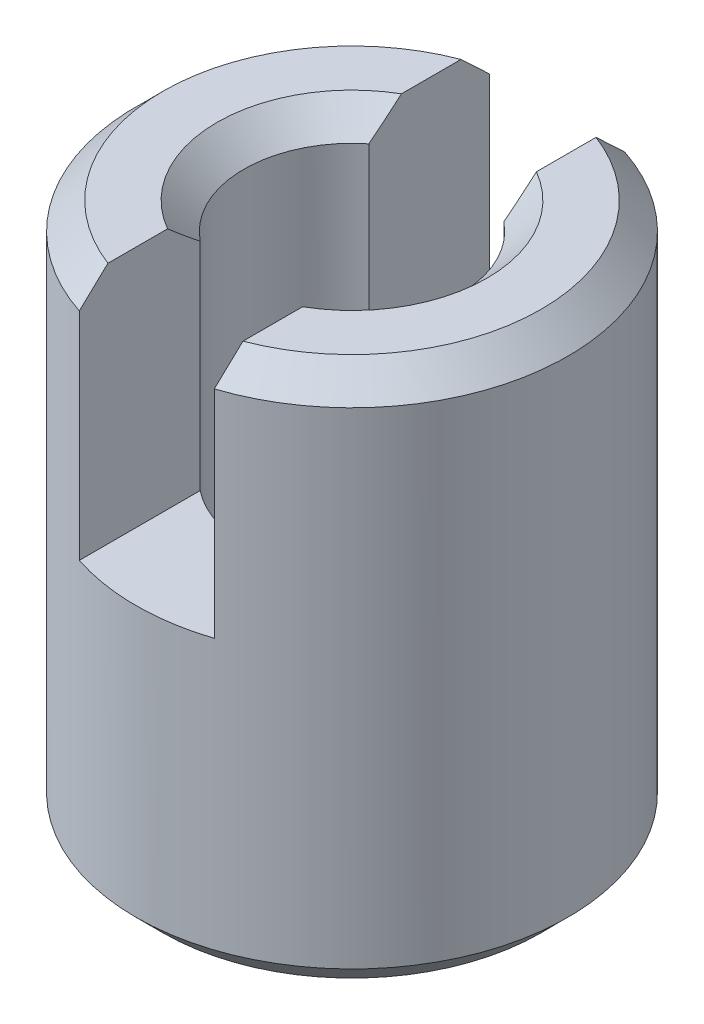
ISO-10303-21;
HEADER;
FILE_DESCRIPTION(('STEP AP214'),'2;1');
FILE_NAME('part.step','',(''),(''),'','','');
FILE_SCHEMA(('AUTOMOTIVE_DESIGN { 1 0 10303 214 1 1 1 1 }'));
ENDSEC;
DATA;
#1=APPLICATION_CONTEXT('core data for automotive mechanical design processes');
#2=APPLICATION_PROTOCOL_DEFINITION('international standard','automotive_design',2000,#1);
#3=PRODUCT_CONTEXT('',#1,'mechanical');
#4=PRODUCT('Part','Part','',(#3));
#5=PRODUCT_RELATED_PRODUCT_CATEGORY('part','',(#4));
#6=PRODUCT_DEFINITION_FORMATION('','',#4);
#7=PRODUCT_DEFINITION_CONTEXT('part definition',#1,'design');
#8=PRODUCT_DEFINITION('design','',#6,#7);
#9=PRODUCT_DEFINITION_SHAPE('','',#8);
#10=(LENGTH_UNIT() NAMED_UNIT(*) SI_UNIT(.MILLI.,.METRE.));
#11=(NAMED_UNIT(*) PLANE_ANGLE_UNIT() SI_UNIT($,.RADIAN.));
#12=(NAMED_UNIT(*) SI_UNIT($,.STERADIAN.) SOLID_ANGLE_UNIT());
#13=UNCERTAINTY_MEASURE_WITH_UNIT(LENGTH_MEASURE(1.E-05),#10,'distance_accuracy_value','');
#14=(GEOMETRIC_REPRESENTATION_CONTEXT(3) GLOBAL_UNCERTAINTY_ASSIGNED_CONTEXT((#13)) GLOBAL_UNIT_ASSIGNED_CONTEXT((#10,
#11,#12)) REPRESENTATION_CONTEXT('',''));
#15=CARTESIAN_POINT('',(0.,0.,0.));
#16=DIRECTION('',(0.,0.,1.));
#17=DIRECTION('',(1.,0.,0.));
#18=AXIS2_PLACEMENT_3D('',#15,#16,#17);
#19=CARTESIAN_POINT('',(0.,10.,0.));
#20=DIRECTION('',(0.,1.,0.));
#21=DIRECTION('',(0.,0.,1.));
#22=AXIS2_PLACEMENT_3D('',#19,#20,#21);
#23=PLANE('',#22);
#24=DIRECTION('',(0.,0.,1.));
#25=VECTOR('',#24,1.);
#26=CARTESIAN_POINT('',(-1.25,10.,-5.));
#27=LINE('',#26,#25);
#28=CARTESIAN_POINT('',(-1.25,10.,2.1650635094611));
#29=VERTEX_POINT('',#28);
#30=CARTESIAN_POINT('',(-1.25,10.,3.26917420765551));
#31=VERTEX_POINT('',#30);
#32=EDGE_CURVE('E145',#29,#31,#27,.T.);
#33=ORIENTED_EDGE('',*,*,#32,.F.);
#34=CARTESIAN_POINT('',(0.,10.,0.));
#35=DIRECTION('',(0.,1.,0.));
#36=DIRECTION('',(0.,0.,1.));
#37=AXIS2_PLACEMENT_3D('',#34,#35,#36);
#38=CIRCLE('',#37,2.5);
#39=CARTESIAN_POINT('',(-1.25,10.,-2.1650635094611));
#40=VERTEX_POINT('',#39);
#41=EDGE_CURVE('E214',#29,#40,#38,.F.);
#42=ORIENTED_EDGE('',*,*,#41,.T.);
#43=CARTESIAN_POINT('',(-1.25,10.,-3.26917420765551));
#44=VERTEX_POINT('',#43);
#45=EDGE_CURVE('E142',#44,#40,#27,.T.);
#46=ORIENTED_EDGE('',*,*,#45,.F.);
#47=CARTESIAN_POINT('',(0.,10.,0.));
#48=DIRECTION('',(0.,1.,0.));
#49=DIRECTION('',(0.,0.,1.));
#50=AXIS2_PLACEMENT_3D('',#47,#48,#49);
#51=CIRCLE('',#50,3.5);
#52=EDGE_CURVE('E296',#44,#31,#51,.T.);
#53=ORIENTED_EDGE('',*,*,#52,.T.);
#54=EDGE_LOOP('',(#33,#42,#46,#53));
#55=FACE_BOUND('',#54,.T.);
#56=ADVANCED_FACE('F16',(#55),#23,.T.);
#57=DIRECTION('',(0.,0.,-1.));
#58=VECTOR('',#57,1.);
#59=CARTESIAN_POINT('',(1.25,10.,-5.));
#60=LINE('',#59,#58);
#61=CARTESIAN_POINT('',(1.25,10.,-2.1650635094611));
#62=VERTEX_POINT('',#61);
#63=CARTESIAN_POINT('',(1.25,10.,-3.26917420765551));
#64=VERTEX_POINT('',#63);
#65=EDGE_CURVE('E144',#62,#64,#60,.T.);
#66=ORIENTED_EDGE('',*,*,#65,.F.);
#67=CARTESIAN_POINT('',(0.,10.,0.));
#68=DIRECTION('',(0.,1.,0.));
#69=DIRECTION('',(0.,0.,1.));
#70=AXIS2_PLACEMENT_3D('',#67,#68,#69);
#71=CIRCLE('',#70,2.5);
#72=CARTESIAN_POINT('',(1.25,10.,2.1650635094611));
#73=VERTEX_POINT('',#72);
#74=EDGE_CURVE('E39',#62,#73,#71,.F.);
#75=ORIENTED_EDGE('',*,*,#74,.T.);
#76=CARTESIAN_POINT('',(1.25,10.,3.26917420765551));
#77=VERTEX_POINT('',#76);
#78=EDGE_CURVE('E140',#77,#73,#60,.T.);
#79=ORIENTED_EDGE('',*,*,#78,.F.);
#80=CARTESIAN_POINT('',(0.,10.,0.));
#81=DIRECTION('',(0.,1.,0.));
#82=DIRECTION('',(0.,0.,1.));
#83=AXIS2_PLACEMENT_3D('',#80,#81,#82);
#84=CIRCLE('',#83,3.5);
#85=EDGE_CURVE('E311',#77,#64,#84,.T.);
#86=ORIENTED_EDGE('',*,*,#85,.T.);
#87=EDGE_LOOP('',(#66,#75,#79,#86));
#88=FACE_BOUND('',#87,.T.);
#89=ADVANCED_FACE('F283',(#88),#23,.T.);
#90=CARTESIAN_POINT('',(0.,0.,0.));
#91=DIRECTION('',(0.,1.,0.));
#92=DIRECTION('',(0.,0.,1.));
#93=AXIS2_PLACEMENT_3D('',#90,#91,#92);
#94=PLANE('',#93);
#95=CARTESIAN_POINT('',(0.,0.,0.));
#96=DIRECTION('',(0.,1.,0.));
#97=DIRECTION('',(0.,0.,1.));
#98=AXIS2_PLACEMENT_3D('',#95,#96,#97);
#99=CIRCLE('',#98,2.5);
#100=CARTESIAN_POINT('',(0.,0.,2.5));
#101=VERTEX_POINT('',#100);
#102=EDGE_CURVE('E10',#101,#101,#99,.T.);
#103=ORIENTED_EDGE('',*,*,#102,.T.);
#104=EDGE_LOOP('',(#103));
#105=FACE_BOUND('',#104,.T.);
#106=CARTESIAN_POINT('',(0.,0.,0.));
#107=DIRECTION('',(0.,1.,0.));
#108=DIRECTION('',(0.,0.,1.));
#109=AXIS2_PLACEMENT_3D('',#106,#107,#108);
#110=CIRCLE('',#109,3.5);
#111=CARTESIAN_POINT('',(0.,0.,3.5));
#112=VERTEX_POINT('',#111);
#113=EDGE_CURVE('E24',#112,#112,#110,.F.);
#114=ORIENTED_EDGE('',*,*,#113,.T.);
#115=EDGE_LOOP('',(#114));
#116=FACE_BOUND('',#115,.T.);
#117=ADVANCED_FACE('F268',(#105,#116),#94,.F.);
#118=CARTESIAN_POINT('',(0.,10.,0.));
#119=DIRECTION('',(0.,-1.,0.));
#120=DIRECTION('',(0.,0.,-1.));
#121=AXIS2_PLACEMENT_3D('',#118,#119,#120);
#122=CYLINDRICAL_SURFACE('',#121,4.);
#123=CARTESIAN_POINT('',(0.,0.500000000000002,0.));
#124=DIRECTION('',(0.,1.,0.));
#125=DIRECTION('',(0.,0.,1.));
#126=AXIS2_PLACEMENT_3D('',#123,#124,#125);
#127=CIRCLE('',#126,4.);
#128=CARTESIAN_POINT('',(0.,0.500000000000002,4.));
#129=VERTEX_POINT('',#128);
#130=EDGE_CURVE('E255',#129,#129,#127,.T.);
#131=ORIENTED_EDGE('',*,*,#130,.T.);
#132=EDGE_LOOP('',(#131));
#133=FACE_BOUND('',#132,.T.);
#134=DIRECTION('',(0.,-1.,0.));
#135=VECTOR('',#134,1.);
#136=CARTESIAN_POINT('',(1.25,10.,-3.79967103839267));
#137=LINE('',#136,#135);
#138=CARTESIAN_POINT('',(1.25,5.5,-3.79967103839267));
#139=VERTEX_POINT('',#138);
#140=CARTESIAN_POINT('',(1.25,9.5,-3.79967103839267));
#141=VERTEX_POINT('',#140);
#142=EDGE_CURVE('E128',#139,#141,#137,.F.);
#143=ORIENTED_EDGE('',*,*,#142,.T.);
#144=CARTESIAN_POINT('',(0.,9.5,0.));
#145=DIRECTION('',(0.,1.,0.));
#146=DIRECTION('',(0.,0.,1.));
#147=AXIS2_PLACEMENT_3D('',#144,#145,#146);
#148=CIRCLE('',#147,4.);
#149=CARTESIAN_POINT('',(1.25,9.5,3.79967103839267));
#150=VERTEX_POINT('',#149);
#151=EDGE_CURVE('E31',#141,#150,#148,.F.);
#152=ORIENTED_EDGE('',*,*,#151,.T.);
#153=DIRECTION('',(0.,-1.,0.));
#154=VECTOR('',#153,1.);
#155=CARTESIAN_POINT('',(1.25,10.,3.79967103839267));
#156=LINE('',#155,#154);
#157=CARTESIAN_POINT('',(1.25,5.5,3.79967103839267));
#158=VERTEX_POINT('',#157);
#159=EDGE_CURVE('E149',#150,#158,#156,.T.);
#160=ORIENTED_EDGE('',*,*,#159,.T.);
#161=CARTESIAN_POINT('',(0.,5.5,0.));
#162=DIRECTION('',(0.,1.,0.));
#163=DIRECTION('',(0.,0.,1.));
#164=AXIS2_PLACEMENT_3D('',#161,#162,#163);
#165=CIRCLE('',#164,4.);
#166=CARTESIAN_POINT('',(-1.25,5.5,3.79967103839267));
#167=VERTEX_POINT('',#166);
#168=EDGE_CURVE('E129',#167,#158,#165,.T.);
#169=ORIENTED_EDGE('',*,*,#168,.F.);
#170=DIRECTION('',(0.,-1.,0.));
#171=VECTOR('',#170,1.);
#172=CARTESIAN_POINT('',(-1.25,10.,3.79967103839267));
#173=LINE('',#172,#171);
#174=CARTESIAN_POINT('',(-1.25,9.5,3.79967103839267));
#175=VERTEX_POINT('',#174);
#176=EDGE_CURVE('E118',#167,#175,#173,.F.);
#177=ORIENTED_EDGE('',*,*,#176,.T.);
#178=CARTESIAN_POINT('',(0.,9.5,0.));
#179=DIRECTION('',(0.,1.,0.));
#180=DIRECTION('',(0.,0.,1.));
#181=AXIS2_PLACEMENT_3D('',#178,#179,#180);
#182=CIRCLE('',#181,4.);
#183=CARTESIAN_POINT('',(-1.25,9.5,-3.79967103839267));
#184=VERTEX_POINT('',#183);
#185=EDGE_CURVE('E113',#175,#184,#182,.F.);
#186=ORIENTED_EDGE('',*,*,#185,.T.);
#187=DIRECTION('',(0.,-1.,0.));
#188=VECTOR('',#187,1.);
#189=CARTESIAN_POINT('',(-1.25,10.,-3.79967103839267));
#190=LINE('',#189,#188);
#191=CARTESIAN_POINT('',(-1.25,5.5,-3.79967103839267));
#192=VERTEX_POINT('',#191);
#193=EDGE_CURVE('E107',#184,#192,#190,.T.);
#194=ORIENTED_EDGE('',*,*,#193,.T.);
#195=EDGE_CURVE('E110',#139,#192,#165,.T.);
#196=ORIENTED_EDGE('',*,*,#195,.F.);
#197=EDGE_LOOP('',(#143,#152,#160,#169,#177,#186,#194,#196));
#198=FACE_BOUND('',#197,.T.);
#199=ADVANCED_FACE('F109',(#133,#198),#122,.T.);
#200=CARTESIAN_POINT('',(0.,10.,0.));
#201=DIRECTION('',(0.,-1.,0.));
#202=DIRECTION('',(0.,0.,-1.));
#203=AXIS2_PLACEMENT_3D('',#200,#201,#202);
#204=CYLINDRICAL_SURFACE('',#203,2.);
#205=CARTESIAN_POINT('',(0.,0.500000000000002,0.));
#206=DIRECTION('',(0.,1.,0.));
#207=DIRECTION('',(0.,0.,1.));
#208=AXIS2_PLACEMENT_3D('',#205,#206,#207);
#209=CIRCLE('',#208,2.);
#210=CARTESIAN_POINT('',(0.,0.500000000000002,2.));
#211=VERTEX_POINT('',#210);
#212=EDGE_CURVE('E164',#211,#211,#209,.F.);
#213=ORIENTED_EDGE('',*,*,#212,.T.);
#214=EDGE_LOOP('',(#213));
#215=FACE_BOUND('',#214,.T.);
#216=DIRECTION('',(0.,-1.,0.));
#217=VECTOR('',#216,1.);
#218=CARTESIAN_POINT('',(-1.25,10.,-1.5612494995996));
#219=LINE('',#218,#217);
#220=CARTESIAN_POINT('',(-1.25,9.5,-1.5612494995996));
#221=VERTEX_POINT('',#220);
#222=CARTESIAN_POINT('',(-1.25,5.5,-1.5612494995996));
#223=VERTEX_POINT('',#222);
#224=EDGE_CURVE('E134',#221,#223,#219,.T.);
#225=ORIENTED_EDGE('',*,*,#224,.F.);
#226=CARTESIAN_POINT('',(0.,9.5,0.));
#227=DIRECTION('',(0.,1.,0.));
#228=DIRECTION('',(0.,0.,1.));
#229=AXIS2_PLACEMENT_3D('',#226,#227,#228);
#230=CIRCLE('',#229,2.);
#231=CARTESIAN_POINT('',(-1.25,9.5,1.5612494995996));
#232=VERTEX_POINT('',#231);
#233=EDGE_CURVE('E170',#221,#232,#230,.T.);
#234=ORIENTED_EDGE('',*,*,#233,.T.);
#235=DIRECTION('',(0.,-1.,0.));
#236=VECTOR('',#235,1.);
#237=CARTESIAN_POINT('',(-1.25,10.,1.5612494995996));
#238=LINE('',#237,#236);
#239=CARTESIAN_POINT('',(-1.25,5.5,1.5612494995996));
#240=VERTEX_POINT('',#239);
#241=EDGE_CURVE('E157',#240,#232,#238,.F.);
#242=ORIENTED_EDGE('',*,*,#241,.F.);
#243=CARTESIAN_POINT('',(0.,5.5,0.));
#244=DIRECTION('',(0.,1.,0.));
#245=DIRECTION('',(0.,0.,1.));
#246=AXIS2_PLACEMENT_3D('',#243,#244,#245);
#247=CIRCLE('',#246,2.);
#248=CARTESIAN_POINT('',(1.25,5.5,1.5612494995996));
#249=VERTEX_POINT('',#248);
#250=EDGE_CURVE('E117',#240,#249,#247,.T.);
#251=ORIENTED_EDGE('',*,*,#250,.T.);
#252=DIRECTION('',(0.,-1.,0.));
#253=VECTOR('',#252,1.);
#254=CARTESIAN_POINT('',(1.25,10.,1.5612494995996));
#255=LINE('',#254,#253);
#256=CARTESIAN_POINT('',(1.25,9.5,1.5612494995996));
#257=VERTEX_POINT('',#256);
#258=EDGE_CURVE('E154',#257,#249,#255,.T.);
#259=ORIENTED_EDGE('',*,*,#258,.F.);
#260=CARTESIAN_POINT('',(0.,9.5,0.));
#261=DIRECTION('',(0.,1.,0.));
#262=DIRECTION('',(0.,0.,1.));
#263=AXIS2_PLACEMENT_3D('',#260,#261,#262);
#264=CIRCLE('',#263,2.);
#265=CARTESIAN_POINT('',(1.25,9.5,-1.5612494995996));
#266=VERTEX_POINT('',#265);
#267=EDGE_CURVE('E167',#257,#266,#264,.T.);
#268=ORIENTED_EDGE('',*,*,#267,.T.);
#269=DIRECTION('',(0.,-1.,0.));
#270=VECTOR('',#269,1.);
#271=CARTESIAN_POINT('',(1.25,10.,-1.5612494995996));
#272=LINE('',#271,#270);
#273=CARTESIAN_POINT('',(1.25,5.5,-1.5612494995996));
#274=VERTEX_POINT('',#273);
#275=EDGE_CURVE('E160',#274,#266,#272,.F.);
#276=ORIENTED_EDGE('',*,*,#275,.F.);
#277=EDGE_CURVE('E155',#274,#223,#247,.T.);
#278=ORIENTED_EDGE('',*,*,#277,.T.);
#279=EDGE_LOOP('',(#225,#234,#242,#251,#259,#268,#276,#278));
#280=FACE_BOUND('',#279,.T.);
#281=ADVANCED_FACE('F200',(#215,#280),#204,.F.);
#282=CARTESIAN_POINT('',(0.,5.5,0.));
#283=DIRECTION('',(0.,1.,0.));
#284=DIRECTION('',(0.,0.,1.));
#285=AXIS2_PLACEMENT_3D('',#282,#283,#284);
#286=PLANE('',#285);
#287=ORIENTED_EDGE('',*,*,#168,.T.);
#288=DIRECTION('',(0.,0.,-1.));
#289=VECTOR('',#288,1.);
#290=CARTESIAN_POINT('',(1.25,5.5,-5.));
#291=LINE('',#290,#289);
#292=EDGE_CURVE('E137',#158,#249,#291,.T.);
#293=ORIENTED_EDGE('',*,*,#292,.T.);
#294=ORIENTED_EDGE('',*,*,#250,.F.);
#295=DIRECTION('',(0.,0.,1.));
#296=VECTOR('',#295,1.);
#297=CARTESIAN_POINT('',(-1.25,5.5,-5.));
#298=LINE('',#297,#296);
#299=EDGE_CURVE('E135',#240,#167,#298,.T.);
#300=ORIENTED_EDGE('',*,*,#299,.T.);
#301=EDGE_LOOP('',(#287,#293,#294,#300));
#302=FACE_BOUND('',#301,.T.);
#303=ADVANCED_FACE('F281',(#302),#286,.T.);
#304=CARTESIAN_POINT('',(1.25,5.5,-5.));
#305=DIRECTION('',(1.,0.,0.));
#306=DIRECTION('',(0.,0.,-1.));
#307=AXIS2_PLACEMENT_3D('',#304,#305,#306);
#308=PLANE('',#307);
#309=ORIENTED_EDGE('',*,*,#78,.T.);
#310=CARTESIAN_POINT('',(1.25,10.,2.1650635094611));
#311=CARTESIAN_POINT('',(1.25,9.95722876751235,2.11566846678581));
#312=CARTESIAN_POINT('',(1.25,9.91465893262686,2.06609747725747));
#313=CARTESIAN_POINT('',(1.25,9.83003324166807,1.96653241535011));
#314=CARTESIAN_POINT('',(1.25,9.78797730583004,1.91653841072159));
#315=CARTESIAN_POINT('',(1.25,9.70447497947979,1.81603811709996));
#316=CARTESIAN_POINT('',(1.25,9.66302861974552,1.76553180245602));
#317=CARTESIAN_POINT('',(1.25,9.58089984725416,1.66388926075775));
#318=CARTESIAN_POINT('',(1.25,9.54021755613969,1.6127529355137));
#319=CARTESIAN_POINT('',(1.25,9.5,1.5612494995996));
#320=B_SPLINE_CURVE_WITH_KNOTS('',3,(#310,#311,#312,#313,#314,#315,#316,#317,#318,#319),
.UNSPECIFIED.,.F.,.F.,(4,2,2,2,4),(0.,0.196019566277538,0.392008310743971,0.588006917084639,
0.784036467072463),.UNSPECIFIED.);
#321=EDGE_CURVE('E248',#73,#257,#320,.T.);
#322=ORIENTED_EDGE('',*,*,#321,.T.);
#323=ORIENTED_EDGE('',*,*,#258,.T.);
#324=ORIENTED_EDGE('',*,*,#292,.F.);
#325=ORIENTED_EDGE('',*,*,#159,.F.);
#326=CARTESIAN_POINT('',(1.25,9.5,3.79967103839267));
#327=CARTESIAN_POINT('',(1.25,9.58367560631239,3.71157849475117));
#328=CARTESIAN_POINT('',(1.25,9.6672076196875,3.6233491606093));
#329=CARTESIAN_POINT('',(1.25,9.7922281797488,3.49074381221077));
#330=CARTESIAN_POINT('',(1.25,9.83385543703688,3.44649849229586));
#331=CARTESIAN_POINT('',(1.25,9.91700732179907,3.3579111618407));
#332=CARTESIAN_POINT('',(1.25,9.95853194882246,3.31356915087742));
#333=CARTESIAN_POINT('',(1.25,10.,3.26917420765551));
#334=B_SPLINE_CURVE_WITH_KNOTS('',3,(#326,#327,#328,#329,#330,#331,#332,#333),.UNSPECIFIED.,.F.,
.F.,(4,2,2,4),(0.,0.364495851134736,0.546743606274993,0.728992160374601),.UNSPECIFIED.);
#335=EDGE_CURVE('E256',#150,#77,#334,.T.);
#336=ORIENTED_EDGE('',*,*,#335,.T.);
#337=EDGE_LOOP('',(#309,#322,#323,#324,#325,#336));
#338=FACE_BOUND('',#337,.T.);
#339=ADVANCED_FACE('F197',(#338),#308,.F.);
#340=CARTESIAN_POINT('',(-1.25,5.5,-5.));
#341=DIRECTION('',(-1.,0.,0.));
#342=DIRECTION('',(0.,0.,1.));
#343=AXIS2_PLACEMENT_3D('',#340,#341,#342);
#344=PLANE('',#343);
#345=ORIENTED_EDGE('',*,*,#241,.T.);
#346=CARTESIAN_POINT('',(-1.25,9.5,1.5612494995996));
#347=CARTESIAN_POINT('',(-1.25,9.54021755613969,1.6127529355137));
#348=CARTESIAN_POINT('',(-1.25,9.58089984725416,1.66388926075775));
#349=CARTESIAN_POINT('',(-1.25,9.66302861974552,1.76553180245602));
#350=CARTESIAN_POINT('',(-1.25,9.70447497947979,1.81603811709996));
#351=CARTESIAN_POINT('',(-1.25,9.78797730583004,1.91653841072159));
#352=CARTESIAN_POINT('',(-1.25,9.83003324166807,1.96653241535012));
#353=CARTESIAN_POINT('',(-1.25,9.91465893262686,2.06609747725747));
#354=CARTESIAN_POINT('',(-1.25,9.95722876751235,2.11566846678581));
#355=CARTESIAN_POINT('',(-1.25,10.,2.1650635094611));
#356=B_SPLINE_CURVE_WITH_KNOTS('',3,(#346,#347,#348,#349,#350,#351,#352,#353,#354,#355),
.UNSPECIFIED.,.F.,.F.,(4,2,2,2,4),(0.,0.196029549987824,0.392028156328491,0.588016900794924,
0.784036467072462),.UNSPECIFIED.);
#357=EDGE_CURVE('E181',#232,#29,#356,.T.);
#358=ORIENTED_EDGE('',*,*,#357,.T.);
#359=ORIENTED_EDGE('',*,*,#32,.T.);
#360=CARTESIAN_POINT('',(-1.25,10.,3.26917420765551));
#361=CARTESIAN_POINT('',(-1.25,9.95853194882246,3.31356915087742));
#362=CARTESIAN_POINT('',(-1.25,9.91700732179907,3.3579111618407));
#363=CARTESIAN_POINT('',(-1.25,9.83385543703688,3.44649849229586));
#364=CARTESIAN_POINT('',(-1.25,9.7922281797488,3.49074381221077));
#365=CARTESIAN_POINT('',(-1.25,9.6672076196875,3.6233491606093));
#366=CARTESIAN_POINT('',(-1.25,9.58367560631239,3.71157849475117));
#367=CARTESIAN_POINT('',(-1.25,9.5,3.79967103839267));
#368=B_SPLINE_CURVE_WITH_KNOTS('',3,(#360,#361,#362,#363,#364,#365,#366,#367),.UNSPECIFIED.,.F.,
.F.,(4,2,2,4),(0.,0.182248554099608,0.364496309239865,0.728992160374601),.UNSPECIFIED.);
#369=EDGE_CURVE('E173',#31,#175,#368,.T.);
#370=ORIENTED_EDGE('',*,*,#369,.T.);
#371=ORIENTED_EDGE('',*,*,#176,.F.);
#372=ORIENTED_EDGE('',*,*,#299,.F.);
#373=EDGE_LOOP('',(#345,#358,#359,#370,#371,#372));
#374=FACE_BOUND('',#373,.T.);
#375=ADVANCED_FACE('F196',(#374),#344,.F.);
#376=ORIENTED_EDGE('',*,*,#45,.T.);
#377=CARTESIAN_POINT('',(-1.25,10.,-2.1650635094611));
#378=CARTESIAN_POINT('',(-1.25,9.95722876751235,-2.11566846678581));
#379=CARTESIAN_POINT('',(-1.25,9.91465893262686,-2.06609747725747));
#380=CARTESIAN_POINT('',(-1.25,9.83003324166807,-1.96653241535011));
#381=CARTESIAN_POINT('',(-1.25,9.78797730583004,-1.91653841072159));
#382=CARTESIAN_POINT('',(-1.25,9.70447497947979,-1.81603811709996));
#383=CARTESIAN_POINT('',(-1.25,9.66302861974552,-1.76553180245602));
#384=CARTESIAN_POINT('',(-1.25,9.58089984725416,-1.66388926075775));
#385=CARTESIAN_POINT('',(-1.25,9.54021755613969,-1.6127529355137));
#386=CARTESIAN_POINT('',(-1.25,9.5,-1.5612494995996));
#387=B_SPLINE_CURVE_WITH_KNOTS('',3,(#377,#378,#379,#380,#381,#382,#383,#384,#385,#386),
.UNSPECIFIED.,.F.,.F.,(4,2,2,2,4),(0.,0.196019566277538,0.392008310743971,0.588006917084639,
0.784036467072462),.UNSPECIFIED.);
#388=EDGE_CURVE('E213',#40,#221,#387,.T.);
#389=ORIENTED_EDGE('',*,*,#388,.T.);
#390=ORIENTED_EDGE('',*,*,#224,.T.);
#391=EDGE_CURVE('E124',#192,#223,#298,.T.);
#392=ORIENTED_EDGE('',*,*,#391,.F.);
#393=ORIENTED_EDGE('',*,*,#193,.F.);
#394=CARTESIAN_POINT('',(-1.25,9.5,-3.79967103839267));
#395=CARTESIAN_POINT('',(-1.25,9.58367560631239,-3.71157849475117));
#396=CARTESIAN_POINT('',(-1.25,9.6672076196875,-3.6233491606093));
#397=CARTESIAN_POINT('',(-1.25,9.7922281797488,-3.49074381221077));
#398=CARTESIAN_POINT('',(-1.25,9.83385543703688,-3.44649849229586));
#399=CARTESIAN_POINT('',(-1.25,9.91700732179907,-3.3579111618407));
#400=CARTESIAN_POINT('',(-1.25,9.95853194882246,-3.31356915087742));
#401=CARTESIAN_POINT('',(-1.25,10.,-3.26917420765551));
#402=B_SPLINE_CURVE_WITH_KNOTS('',3,(#394,#395,#396,#397,#398,#399,#400,#401),.UNSPECIFIED.,.F.,
.F.,(4,2,2,4),(0.,0.364495851134736,0.546743606274993,0.728992160374601),.UNSPECIFIED.);
#403=EDGE_CURVE('E207',#184,#44,#402,.T.);
#404=ORIENTED_EDGE('',*,*,#403,.T.);
#405=EDGE_LOOP('',(#376,#389,#390,#392,#393,#404));
#406=FACE_BOUND('',#405,.T.);
#407=ADVANCED_FACE('F132',(#406),#344,.F.);
#408=ORIENTED_EDGE('',*,*,#275,.T.);
#409=CARTESIAN_POINT('',(1.25,9.5,-1.5612494995996));
#410=CARTESIAN_POINT('',(1.25,9.54021755613969,-1.6127529355137));
#411=CARTESIAN_POINT('',(1.25,9.58089984725416,-1.66388926075775));
#412=CARTESIAN_POINT('',(1.25,9.66302861974552,-1.76553180245602));
#413=CARTESIAN_POINT('',(1.25,9.70447497947979,-1.81603811709996));
#414=CARTESIAN_POINT('',(1.25,9.78797730583004,-1.91653841072159));
#415=CARTESIAN_POINT('',(1.25,9.83003324166807,-1.96653241535011));
#416=CARTESIAN_POINT('',(1.25,9.91465893262686,-2.06609747725747));
#417=CARTESIAN_POINT('',(1.25,9.95722876751235,-2.11566846678581));
#418=CARTESIAN_POINT('',(1.25,10.,-2.1650635094611));
#419=B_SPLINE_CURVE_WITH_KNOTS('',3,(#409,#410,#411,#412,#413,#414,#415,#416,#417,#418),
.UNSPECIFIED.,.F.,.F.,(4,2,2,2,4),(0.,0.196029549987824,0.392028156328491,0.588016900794924,
0.784036467072462),.UNSPECIFIED.);
#420=EDGE_CURVE('E241',#266,#62,#419,.T.);
#421=ORIENTED_EDGE('',*,*,#420,.T.);
#422=ORIENTED_EDGE('',*,*,#65,.T.);
#423=CARTESIAN_POINT('',(1.25,10.,-3.26917420765551));
#424=CARTESIAN_POINT('',(1.25,9.95853194882246,-3.31356915087742));
#425=CARTESIAN_POINT('',(1.25,9.91700732179907,-3.3579111618407));
#426=CARTESIAN_POINT('',(1.25,9.83385543703688,-3.44649849229586));
#427=CARTESIAN_POINT('',(1.25,9.7922281797488,-3.49074381221077));
#428=CARTESIAN_POINT('',(1.25,9.6672076196875,-3.6233491606093));
#429=CARTESIAN_POINT('',(1.25,9.58367560631239,-3.71157849475117));
#430=CARTESIAN_POINT('',(1.25,9.5,-3.79967103839267));
#431=B_SPLINE_CURVE_WITH_KNOTS('',3,(#423,#424,#425,#426,#427,#428,#429,#430),.UNSPECIFIED.,.F.,
.F.,(4,2,2,4),(0.,0.182248554099608,0.364496309239865,0.728992160374602),.UNSPECIFIED.);
#432=EDGE_CURVE('E220',#64,#141,#431,.T.);
#433=ORIENTED_EDGE('',*,*,#432,.T.);
#434=ORIENTED_EDGE('',*,*,#142,.F.);
#435=EDGE_CURVE('E127',#274,#139,#291,.T.);
#436=ORIENTED_EDGE('',*,*,#435,.F.);
#437=EDGE_LOOP('',(#408,#421,#422,#433,#434,#436));
#438=FACE_BOUND('',#437,.T.);
#439=ADVANCED_FACE('F195',(#438),#308,.F.);
#440=ORIENTED_EDGE('',*,*,#195,.T.);
#441=ORIENTED_EDGE('',*,*,#391,.T.);
#442=ORIENTED_EDGE('',*,*,#277,.F.);
#443=ORIENTED_EDGE('',*,*,#435,.T.);
#444=EDGE_LOOP('',(#440,#441,#442,#443));
#445=FACE_BOUND('',#444,.T.);
#446=ADVANCED_FACE('F123',(#445),#286,.T.);
#447=CARTESIAN_POINT('',(0.,9.5,0.));
#448=DIRECTION('',(0.,1.,0.));
#449=DIRECTION('',(0.,0.,1.));
#450=AXIS2_PLACEMENT_3D('',#447,#448,#449);
#451=CONICAL_SURFACE('',#450,2.,0.78539816339745);
#452=ORIENTED_EDGE('',*,*,#388,.F.);
#453=ORIENTED_EDGE('',*,*,#41,.F.);
#454=ORIENTED_EDGE('',*,*,#357,.F.);
#455=ORIENTED_EDGE('',*,*,#233,.F.);
#456=EDGE_LOOP('',(#452,#453,#454,#455));
#457=FACE_BOUND('',#456,.T.);
#458=ADVANCED_FACE('F226',(#457),#451,.F.);
#459=CARTESIAN_POINT('',(0.,9.5,0.));
#460=DIRECTION('',(0.,1.,0.));
#461=DIRECTION('',(0.,0.,1.));
#462=AXIS2_PLACEMENT_3D('',#459,#460,#461);
#463=CONICAL_SURFACE('',#462,2.,0.78539816339745);
#464=ORIENTED_EDGE('',*,*,#321,.F.);
#465=ORIENTED_EDGE('',*,*,#74,.F.);
#466=ORIENTED_EDGE('',*,*,#420,.F.);
#467=ORIENTED_EDGE('',*,*,#267,.F.);
#468=EDGE_LOOP('',(#464,#465,#466,#467));
#469=FACE_BOUND('',#468,.T.);
#470=ADVANCED_FACE('F231',(#469),#463,.F.);
#471=CARTESIAN_POINT('',(0.,10.,0.));
#472=DIRECTION('',(0.,-1.,0.));
#473=DIRECTION('',(0.,0.,-1.));
#474=AXIS2_PLACEMENT_3D('',#471,#472,#473);
#475=CONICAL_SURFACE('',#474,3.5,0.785398163397447);
#476=ORIENTED_EDGE('',*,*,#335,.F.);
#477=ORIENTED_EDGE('',*,*,#151,.F.);
#478=ORIENTED_EDGE('',*,*,#432,.F.);
#479=ORIENTED_EDGE('',*,*,#85,.F.);
#480=EDGE_LOOP('',(#476,#477,#478,#479));
#481=FACE_BOUND('',#480,.T.);
#482=ADVANCED_FACE('F237',(#481),#475,.T.);
#483=CARTESIAN_POINT('',(0.,10.,0.));
#484=DIRECTION('',(0.,-1.,0.));
#485=DIRECTION('',(0.,0.,-1.));
#486=AXIS2_PLACEMENT_3D('',#483,#484,#485);
#487=CONICAL_SURFACE('',#486,3.5,0.785398163397447);
#488=ORIENTED_EDGE('',*,*,#403,.F.);
#489=ORIENTED_EDGE('',*,*,#185,.F.);
#490=ORIENTED_EDGE('',*,*,#369,.F.);
#491=ORIENTED_EDGE('',*,*,#52,.F.);
#492=EDGE_LOOP('',(#488,#489,#490,#491));
#493=FACE_BOUND('',#492,.T.);
#494=ADVANCED_FACE('F188',(#493),#487,.T.);
#495=CARTESIAN_POINT('',(0.,0.,0.));
#496=DIRECTION('',(0.,-1.,0.));
#497=DIRECTION('',(0.,0.,-1.));
#498=AXIS2_PLACEMENT_3D('',#495,#496,#497);
#499=CONICAL_SURFACE('',#498,2.5,0.785398163397447);
#500=ORIENTED_EDGE('',*,*,#212,.F.);
#501=EDGE_LOOP('',(#500));
#502=FACE_BOUND('',#501,.T.);
#503=ORIENTED_EDGE('',*,*,#102,.F.);
#504=EDGE_LOOP('',(#503));
#505=FACE_BOUND('',#504,.T.);
#506=ADVANCED_FACE('F272',(#502,#505),#499,.F.);
#507=CARTESIAN_POINT('',(0.,0.500000000000002,0.));
#508=DIRECTION('',(0.,1.,0.));
#509=DIRECTION('',(0.,0.,1.));
#510=AXIS2_PLACEMENT_3D('',#507,#508,#509);
#511=CONICAL_SURFACE('',#510,4.,0.78539816339745);
#512=ORIENTED_EDGE('',*,*,#113,.F.);
#513=EDGE_LOOP('',(#512));
#514=FACE_BOUND('',#513,.T.);
#515=ORIENTED_EDGE('',*,*,#130,.F.);
#516=EDGE_LOOP('',(#515));
#517=FACE_BOUND('',#516,.T.);
#518=ADVANCED_FACE('F18',(#514,#517),#511,.T.);
#519=CLOSED_SHELL('',(#56,#89,#117,#199,#281,#303,#339,#375,#407,#439,#446,#458,#470,#482,#494,
#506,#518));
#520=MANIFOLD_SOLID_BREP('B1',#519);
#521=ADVANCED_BREP_SHAPE_REPRESENTATION('',(#18,#520),#14);
#522=SHAPE_DEFINITION_REPRESENTATION(#9,#521);
ENDSEC;
END-ISO-10303-21;
